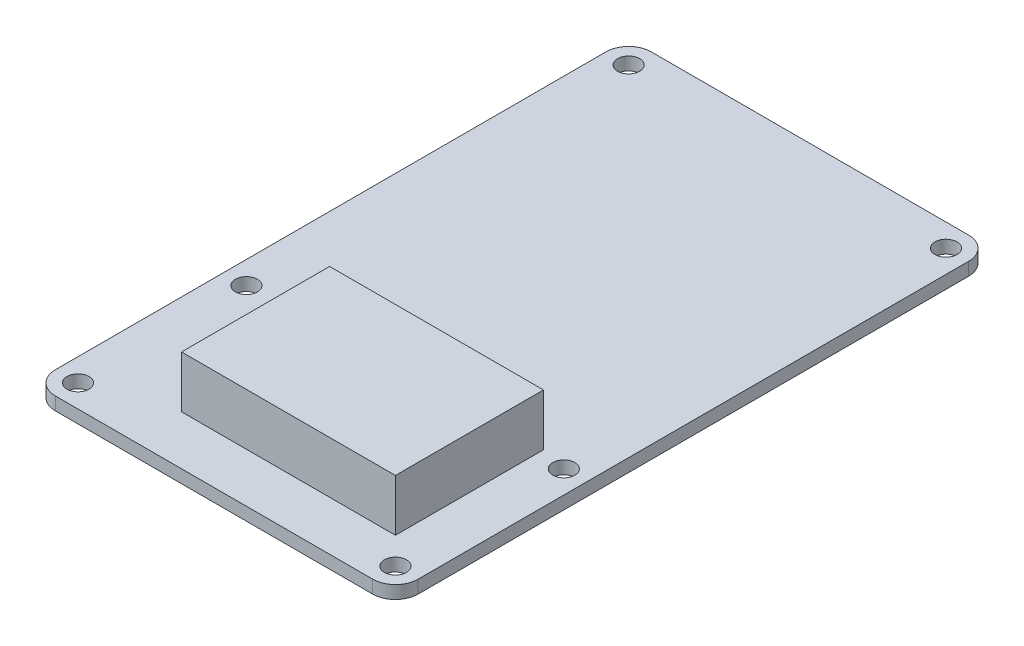
ISO-10303-21;
HEADER;
FILE_DESCRIPTION(('STEP AP214'),'2;1');
FILE_NAME('part.step','',(''),(''),'','','');
FILE_SCHEMA(('AUTOMOTIVE_DESIGN { 1 0 10303 214 1 1 1 1 }'));
ENDSEC;
DATA;
#1=APPLICATION_CONTEXT('core data for automotive mechanical design processes');
#2=APPLICATION_PROTOCOL_DEFINITION('international standard','automotive_design',2000,#1);
#3=PRODUCT_CONTEXT('',#1,'mechanical');
#4=PRODUCT('Part','Part','',(#3));
#5=PRODUCT_RELATED_PRODUCT_CATEGORY('part','',(#4));
#6=PRODUCT_DEFINITION_FORMATION('','',#4);
#7=PRODUCT_DEFINITION_CONTEXT('part definition',#1,'design');
#8=PRODUCT_DEFINITION('design','',#6,#7);
#9=PRODUCT_DEFINITION_SHAPE('','',#8);
#10=(LENGTH_UNIT() NAMED_UNIT(*) SI_UNIT(.MILLI.,.METRE.));
#11=(NAMED_UNIT(*) PLANE_ANGLE_UNIT() SI_UNIT($,.RADIAN.));
#12=(NAMED_UNIT(*) SI_UNIT($,.STERADIAN.) SOLID_ANGLE_UNIT());
#13=UNCERTAINTY_MEASURE_WITH_UNIT(LENGTH_MEASURE(1.E-05),#10,'distance_accuracy_value','');
#14=(GEOMETRIC_REPRESENTATION_CONTEXT(3) GLOBAL_UNCERTAINTY_ASSIGNED_CONTEXT((#13)) GLOBAL_UNIT_ASSIGNED_CONTEXT((#10,
#11,#12)) REPRESENTATION_CONTEXT('',''));
#15=CARTESIAN_POINT('',(0.,0.,0.));
#16=DIRECTION('',(0.,0.,1.));
#17=DIRECTION('',(1.,0.,0.));
#18=AXIS2_PLACEMENT_3D('',#15,#16,#17);
#19=CARTESIAN_POINT('',(24.5,2.,42.5));
#20=DIRECTION('',(0.,-1.,0.));
#21=DIRECTION('',(0.,0.,-1.));
#22=AXIS2_PLACEMENT_3D('',#19,#20,#21);
#23=PLANE('',#22);
#24=CARTESIAN_POINT('',(24.5,2.,42.5));
#25=DIRECTION('',(0.,-1.,0.));
#26=DIRECTION('',(0.,0.,-1.));
#27=AXIS2_PLACEMENT_3D('',#24,#25,#26);
#28=CIRCLE('',#27,1.7);
#29=CARTESIAN_POINT('',(24.5,2.,40.8));
#30=VERTEX_POINT('',#29);
#31=EDGE_CURVE('E254',#30,#30,#28,.T.);
#32=ORIENTED_EDGE('',*,*,#31,.T.);
#33=EDGE_LOOP('',(#32));
#34=FACE_BOUND('',#33,.T.);
#35=CARTESIAN_POINT('',(-24.5,2.,42.5));
#36=DIRECTION('',(0.,-1.,0.));
#37=DIRECTION('',(0.,0.,-1.));
#38=AXIS2_PLACEMENT_3D('',#35,#36,#37);
#39=CIRCLE('',#38,1.7);
#40=CARTESIAN_POINT('',(-24.5,2.,40.8));
#41=VERTEX_POINT('',#40);
#42=EDGE_CURVE('E248',#41,#41,#39,.T.);
#43=ORIENTED_EDGE('',*,*,#42,.T.);
#44=EDGE_LOOP('',(#43));
#45=FACE_BOUND('',#44,.T.);
#46=CARTESIAN_POINT('',(-24.5,2.,16.5));
#47=DIRECTION('',(0.,-1.,0.));
#48=DIRECTION('',(0.,0.,-1.));
#49=AXIS2_PLACEMENT_3D('',#46,#47,#48);
#50=CIRCLE('',#49,1.7);
#51=CARTESIAN_POINT('',(-24.5,2.,14.8));
#52=VERTEX_POINT('',#51);
#53=EDGE_CURVE('E242',#52,#52,#50,.T.);
#54=ORIENTED_EDGE('',*,*,#53,.T.);
#55=EDGE_LOOP('',(#54));
#56=FACE_BOUND('',#55,.T.);
#57=CARTESIAN_POINT('',(24.5,2.,16.5));
#58=DIRECTION('',(0.,-1.,0.));
#59=DIRECTION('',(0.,0.,-1.));
#60=AXIS2_PLACEMENT_3D('',#57,#58,#59);
#61=CIRCLE('',#60,1.7);
#62=CARTESIAN_POINT('',(24.5,2.,14.8));
#63=VERTEX_POINT('',#62);
#64=EDGE_CURVE('E236',#63,#63,#61,.T.);
#65=ORIENTED_EDGE('',*,*,#64,.T.);
#66=EDGE_LOOP('',(#65));
#67=FACE_BOUND('',#66,.T.);
#68=CARTESIAN_POINT('',(24.5,2.,-42.5));
#69=DIRECTION('',(0.,-1.,0.));
#70=DIRECTION('',(0.,0.,-1.));
#71=AXIS2_PLACEMENT_3D('',#68,#69,#70);
#72=CIRCLE('',#71,1.7);
#73=CARTESIAN_POINT('',(24.5,2.,-44.2));
#74=VERTEX_POINT('',#73);
#75=EDGE_CURVE('E230',#74,#74,#72,.T.);
#76=ORIENTED_EDGE('',*,*,#75,.T.);
#77=EDGE_LOOP('',(#76));
#78=FACE_BOUND('',#77,.T.);
#79=CARTESIAN_POINT('',(-24.5,2.,-42.5));
#80=DIRECTION('',(0.,-1.,0.));
#81=DIRECTION('',(0.,0.,-1.));
#82=AXIS2_PLACEMENT_3D('',#79,#80,#81);
#83=CIRCLE('',#82,1.7);
#84=CARTESIAN_POINT('',(-24.5,2.,-44.2));
#85=VERTEX_POINT('',#84);
#86=EDGE_CURVE('E224',#85,#85,#83,.T.);
#87=ORIENTED_EDGE('',*,*,#86,.T.);
#88=EDGE_LOOP('',(#87));
#89=FACE_BOUND('',#88,.T.);
#90=CARTESIAN_POINT('',(24.5,2.,42.5));
#91=DIRECTION('',(0.,1.,0.));
#92=DIRECTION('',(0.,0.,-1.));
#93=AXIS2_PLACEMENT_3D('',#90,#91,#92);
#94=CIRCLE('',#93,3.5);
#95=CARTESIAN_POINT('',(24.5,2.,46.));
#96=VERTEX_POINT('',#95);
#97=CARTESIAN_POINT('',(28.,2.,42.5));
#98=VERTEX_POINT('',#97);
#99=EDGE_CURVE('E159',#96,#98,#94,.T.);
#100=ORIENTED_EDGE('',*,*,#99,.T.);
#101=DIRECTION('',(0.,0.,-1.));
#102=VECTOR('',#101,1.);
#103=CARTESIAN_POINT('',(28.,2.,-42.5));
#104=LINE('',#103,#102);
#105=CARTESIAN_POINT('',(28.,2.,-42.5));
#106=VERTEX_POINT('',#105);
#107=EDGE_CURVE('E100',#98,#106,#104,.T.);
#108=ORIENTED_EDGE('',*,*,#107,.T.);
#109=CARTESIAN_POINT('',(24.5,2.,-42.5));
#110=DIRECTION('',(0.,1.,0.));
#111=DIRECTION('',(0.,0.,-1.));
#112=AXIS2_PLACEMENT_3D('',#109,#110,#111);
#113=CIRCLE('',#112,3.5);
#114=CARTESIAN_POINT('',(24.5,2.,-46.));
#115=VERTEX_POINT('',#114);
#116=EDGE_CURVE('E174',#106,#115,#113,.T.);
#117=ORIENTED_EDGE('',*,*,#116,.T.);
#118=DIRECTION('',(-1.,0.,0.));
#119=VECTOR('',#118,1.);
#120=CARTESIAN_POINT('',(24.5,2.,-46.));
#121=LINE('',#120,#119);
#122=CARTESIAN_POINT('',(-24.5,2.,-46.));
#123=VERTEX_POINT('',#122);
#124=EDGE_CURVE('E186',#115,#123,#121,.T.);
#125=ORIENTED_EDGE('',*,*,#124,.T.);
#126=CARTESIAN_POINT('',(-24.5,2.,-42.5));
#127=DIRECTION('',(0.,1.,0.));
#128=DIRECTION('',(0.,0.,1.));
#129=AXIS2_PLACEMENT_3D('',#126,#127,#128);
#130=CIRCLE('',#129,3.5);
#131=CARTESIAN_POINT('',(-28.,2.,-42.5));
#132=VERTEX_POINT('',#131);
#133=EDGE_CURVE('E122',#123,#132,#130,.T.);
#134=ORIENTED_EDGE('',*,*,#133,.T.);
#135=DIRECTION('',(0.,0.,1.));
#136=VECTOR('',#135,1.);
#137=CARTESIAN_POINT('',(-28.,2.,-42.5));
#138=LINE('',#137,#136);
#139=CARTESIAN_POINT('',(-28.,2.,42.5));
#140=VERTEX_POINT('',#139);
#141=EDGE_CURVE('E115',#132,#140,#138,.T.);
#142=ORIENTED_EDGE('',*,*,#141,.T.);
#143=CARTESIAN_POINT('',(-24.5,2.,42.5));
#144=DIRECTION('',(0.,1.,0.));
#145=DIRECTION('',(0.,0.,-1.));
#146=AXIS2_PLACEMENT_3D('',#143,#144,#145);
#147=CIRCLE('',#146,3.50000000000001);
#148=CARTESIAN_POINT('',(-24.5,2.,46.));
#149=VERTEX_POINT('',#148);
#150=EDGE_CURVE('E119',#140,#149,#147,.T.);
#151=ORIENTED_EDGE('',*,*,#150,.T.);
#152=DIRECTION('',(1.,0.,0.));
#153=VECTOR('',#152,1.);
#154=CARTESIAN_POINT('',(24.5,2.,46.));
#155=LINE('',#154,#153);
#156=EDGE_CURVE('E59',#149,#96,#155,.T.);
#157=ORIENTED_EDGE('',*,*,#156,.T.);
#158=EDGE_LOOP('',(#100,#108,#117,#125,#134,#142,#151,#157));
#159=FACE_BOUND('',#158,.T.);
#160=DIRECTION('',(0.,0.,1.));
#161=VECTOR('',#160,1.);
#162=CARTESIAN_POINT('',(-12.64,2.,42.5));
#163=LINE('',#162,#161);
#164=CARTESIAN_POINT('',(-12.64,2.,15.52));
#165=VERTEX_POINT('',#164);
#166=CARTESIAN_POINT('',(-12.64,2.,38.38));
#167=VERTEX_POINT('',#166);
#168=EDGE_CURVE('E147',#165,#167,#163,.T.);
#169=ORIENTED_EDGE('',*,*,#168,.F.);
#170=DIRECTION('',(1.,0.,0.));
#171=VECTOR('',#170,1.);
#172=CARTESIAN_POINT('',(24.5,2.,15.52));
#173=LINE('',#172,#171);
#174=CARTESIAN_POINT('',(20.38,2.,15.52));
#175=VERTEX_POINT('',#174);
#176=EDGE_CURVE('E200',#165,#175,#173,.T.);
#177=ORIENTED_EDGE('',*,*,#176,.T.);
#178=DIRECTION('',(0.,0.,1.));
#179=VECTOR('',#178,1.);
#180=CARTESIAN_POINT('',(20.38,2.,42.5));
#181=LINE('',#180,#179);
#182=CARTESIAN_POINT('',(20.38,2.,38.38));
#183=VERTEX_POINT('',#182);
#184=EDGE_CURVE('E197',#175,#183,#181,.T.);
#185=ORIENTED_EDGE('',*,*,#184,.T.);
#186=DIRECTION('',(1.,0.,0.));
#187=VECTOR('',#186,1.);
#188=CARTESIAN_POINT('',(24.5,2.,38.38));
#189=LINE('',#188,#187);
#190=EDGE_CURVE('E194',#167,#183,#189,.T.);
#191=ORIENTED_EDGE('',*,*,#190,.F.);
#192=EDGE_LOOP('',(#169,#177,#185,#191));
#193=FACE_BOUND('',#192,.T.);
#194=ADVANCED_FACE('F35',(#34,#45,#56,#67,#78,#89,#159,#193),#23,.F.);
#195=CARTESIAN_POINT('',(24.5,2.,42.5));
#196=DIRECTION('',(0.,-1.,0.));
#197=DIRECTION('',(0.,0.,-1.));
#198=AXIS2_PLACEMENT_3D('',#195,#196,#197);
#199=CYLINDRICAL_SURFACE('',#198,3.5);
#200=CARTESIAN_POINT('',(24.5,0.,42.5));
#201=DIRECTION('',(0.,1.,0.));
#202=DIRECTION('',(0.,0.,-1.));
#203=AXIS2_PLACEMENT_3D('',#200,#201,#202);
#204=CIRCLE('',#203,3.5);
#205=CARTESIAN_POINT('',(24.5,0.,46.));
#206=VERTEX_POINT('',#205);
#207=CARTESIAN_POINT('',(28.,0.,42.5));
#208=VERTEX_POINT('',#207);
#209=EDGE_CURVE('E143',#206,#208,#204,.T.);
#210=ORIENTED_EDGE('',*,*,#209,.T.);
#211=DIRECTION('',(0.,-1.,0.));
#212=VECTOR('',#211,1.);
#213=CARTESIAN_POINT('',(28.,2.,42.5));
#214=LINE('',#213,#212);
#215=EDGE_CURVE('E11',#98,#208,#214,.T.);
#216=ORIENTED_EDGE('',*,*,#215,.F.);
#217=ORIENTED_EDGE('',*,*,#99,.F.);
#218=DIRECTION('',(0.,-1.,0.));
#219=VECTOR('',#218,1.);
#220=CARTESIAN_POINT('',(24.5,2.,46.));
#221=LINE('',#220,#219);
#222=EDGE_CURVE('E139',#96,#206,#221,.T.);
#223=ORIENTED_EDGE('',*,*,#222,.T.);
#224=EDGE_LOOP('',(#210,#216,#217,#223));
#225=FACE_BOUND('',#224,.T.);
#226=ADVANCED_FACE('F37',(#225),#199,.T.);
#227=CARTESIAN_POINT('',(28.,2.,-42.5));
#228=DIRECTION('',(-1.,0.,0.));
#229=DIRECTION('',(0.,0.,1.));
#230=AXIS2_PLACEMENT_3D('',#227,#228,#229);
#231=PLANE('',#230);
#232=DIRECTION('',(0.,0.,-1.));
#233=VECTOR('',#232,1.);
#234=CARTESIAN_POINT('',(28.,0.,-42.5));
#235=LINE('',#234,#233);
#236=CARTESIAN_POINT('',(28.,0.,-42.5));
#237=VERTEX_POINT('',#236);
#238=EDGE_CURVE('E146',#208,#237,#235,.T.);
#239=ORIENTED_EDGE('',*,*,#238,.T.);
#240=DIRECTION('',(0.,-1.,0.));
#241=VECTOR('',#240,1.);
#242=CARTESIAN_POINT('',(28.,2.,-42.5));
#243=LINE('',#242,#241);
#244=EDGE_CURVE('E43',#106,#237,#243,.T.);
#245=ORIENTED_EDGE('',*,*,#244,.F.);
#246=ORIENTED_EDGE('',*,*,#107,.F.);
#247=ORIENTED_EDGE('',*,*,#215,.T.);
#248=EDGE_LOOP('',(#239,#245,#246,#247));
#249=FACE_BOUND('',#248,.T.);
#250=ADVANCED_FACE('F293',(#249),#231,.F.);
#251=CARTESIAN_POINT('',(24.5,2.,-42.5));
#252=DIRECTION('',(0.,-1.,0.));
#253=DIRECTION('',(0.,0.,-1.));
#254=AXIS2_PLACEMENT_3D('',#251,#252,#253);
#255=CYLINDRICAL_SURFACE('',#254,3.5);
#256=CARTESIAN_POINT('',(24.5,0.,-42.5));
#257=DIRECTION('',(0.,1.,0.));
#258=DIRECTION('',(0.,0.,-1.));
#259=AXIS2_PLACEMENT_3D('',#256,#257,#258);
#260=CIRCLE('',#259,3.5);
#261=CARTESIAN_POINT('',(24.5,0.,-46.));
#262=VERTEX_POINT('',#261);
#263=EDGE_CURVE('E149',#237,#262,#260,.T.);
#264=ORIENTED_EDGE('',*,*,#263,.T.);
#265=DIRECTION('',(0.,-1.,0.));
#266=VECTOR('',#265,1.);
#267=CARTESIAN_POINT('',(24.5,2.,-46.));
#268=LINE('',#267,#266);
#269=EDGE_CURVE('E166',#115,#262,#268,.T.);
#270=ORIENTED_EDGE('',*,*,#269,.F.);
#271=ORIENTED_EDGE('',*,*,#116,.F.);
#272=ORIENTED_EDGE('',*,*,#244,.T.);
#273=EDGE_LOOP('',(#264,#270,#271,#272));
#274=FACE_BOUND('',#273,.T.);
#275=ADVANCED_FACE('F172',(#274),#255,.T.);
#276=CARTESIAN_POINT('',(24.5,2.,-46.));
#277=DIRECTION('',(0.,0.,1.));
#278=DIRECTION('',(1.,0.,0.));
#279=AXIS2_PLACEMENT_3D('',#276,#277,#278);
#280=PLANE('',#279);
#281=DIRECTION('',(-1.,0.,0.));
#282=VECTOR('',#281,1.);
#283=CARTESIAN_POINT('',(24.5,0.,-46.));
#284=LINE('',#283,#282);
#285=CARTESIAN_POINT('',(-24.5,0.,-46.));
#286=VERTEX_POINT('',#285);
#287=EDGE_CURVE('E151',#262,#286,#284,.T.);
#288=ORIENTED_EDGE('',*,*,#287,.T.);
#289=DIRECTION('',(0.,-1.,0.));
#290=VECTOR('',#289,1.);
#291=CARTESIAN_POINT('',(-24.5,2.,-46.));
#292=LINE('',#291,#290);
#293=EDGE_CURVE('E163',#123,#286,#292,.T.);
#294=ORIENTED_EDGE('',*,*,#293,.F.);
#295=ORIENTED_EDGE('',*,*,#124,.F.);
#296=ORIENTED_EDGE('',*,*,#269,.T.);
#297=EDGE_LOOP('',(#288,#294,#295,#296));
#298=FACE_BOUND('',#297,.T.);
#299=ADVANCED_FACE('F182',(#298),#280,.F.);
#300=CARTESIAN_POINT('',(-24.5,2.,-42.5));
#301=DIRECTION('',(0.,-1.,0.));
#302=DIRECTION('',(0.,0.,-1.));
#303=AXIS2_PLACEMENT_3D('',#300,#301,#302);
#304=CYLINDRICAL_SURFACE('',#303,3.5);
#305=CARTESIAN_POINT('',(-24.5,0.,-42.5));
#306=DIRECTION('',(0.,1.,0.));
#307=DIRECTION('',(0.,0.,1.));
#308=AXIS2_PLACEMENT_3D('',#305,#306,#307);
#309=CIRCLE('',#308,3.5);
#310=CARTESIAN_POINT('',(-28.,0.,-42.5));
#311=VERTEX_POINT('',#310);
#312=EDGE_CURVE('E153',#286,#311,#309,.T.);
#313=ORIENTED_EDGE('',*,*,#312,.T.);
#314=DIRECTION('',(0.,-1.,0.));
#315=VECTOR('',#314,1.);
#316=CARTESIAN_POINT('',(-28.,2.,-42.5));
#317=LINE('',#316,#315);
#318=EDGE_CURVE('E134',#132,#311,#317,.T.);
#319=ORIENTED_EDGE('',*,*,#318,.F.);
#320=ORIENTED_EDGE('',*,*,#133,.F.);
#321=ORIENTED_EDGE('',*,*,#293,.T.);
#322=EDGE_LOOP('',(#313,#319,#320,#321));
#323=FACE_BOUND('',#322,.T.);
#324=ADVANCED_FACE('F185',(#323),#304,.T.);
#325=CARTESIAN_POINT('',(-28.,2.,-42.5));
#326=DIRECTION('',(1.,0.,0.));
#327=DIRECTION('',(0.,0.,-1.));
#328=AXIS2_PLACEMENT_3D('',#325,#326,#327);
#329=PLANE('',#328);
#330=DIRECTION('',(0.,0.,1.));
#331=VECTOR('',#330,1.);
#332=CARTESIAN_POINT('',(-28.,0.,-42.5));
#333=LINE('',#332,#331);
#334=CARTESIAN_POINT('',(-28.,0.,42.5));
#335=VERTEX_POINT('',#334);
#336=EDGE_CURVE('E131',#311,#335,#333,.T.);
#337=ORIENTED_EDGE('',*,*,#336,.T.);
#338=DIRECTION('',(0.,-1.,0.));
#339=VECTOR('',#338,1.);
#340=CARTESIAN_POINT('',(-28.,2.,42.5));
#341=LINE('',#340,#339);
#342=EDGE_CURVE('E128',#140,#335,#341,.T.);
#343=ORIENTED_EDGE('',*,*,#342,.F.);
#344=ORIENTED_EDGE('',*,*,#141,.F.);
#345=ORIENTED_EDGE('',*,*,#318,.T.);
#346=EDGE_LOOP('',(#337,#343,#344,#345));
#347=FACE_BOUND('',#346,.T.);
#348=ADVANCED_FACE('F129',(#347),#329,.F.);
#349=CARTESIAN_POINT('',(-24.5,2.,42.5));
#350=DIRECTION('',(0.,-1.,0.));
#351=DIRECTION('',(0.,0.,-1.));
#352=AXIS2_PLACEMENT_3D('',#349,#350,#351);
#353=CYLINDRICAL_SURFACE('',#352,3.50000000000001);
#354=CARTESIAN_POINT('',(-24.5,0.,42.5));
#355=DIRECTION('',(0.,1.,0.));
#356=DIRECTION('',(0.,0.,-1.));
#357=AXIS2_PLACEMENT_3D('',#354,#355,#356);
#358=CIRCLE('',#357,3.50000000000001);
#359=CARTESIAN_POINT('',(-24.5,0.,46.));
#360=VERTEX_POINT('',#359);
#361=EDGE_CURVE('E156',#335,#360,#358,.T.);
#362=ORIENTED_EDGE('',*,*,#361,.T.);
#363=DIRECTION('',(0.,-1.,0.));
#364=VECTOR('',#363,1.);
#365=CARTESIAN_POINT('',(-24.5,2.,46.));
#366=LINE('',#365,#364);
#367=EDGE_CURVE('E135',#149,#360,#366,.T.);
#368=ORIENTED_EDGE('',*,*,#367,.F.);
#369=ORIENTED_EDGE('',*,*,#150,.F.);
#370=ORIENTED_EDGE('',*,*,#342,.T.);
#371=EDGE_LOOP('',(#362,#368,#369,#370));
#372=FACE_BOUND('',#371,.T.);
#373=ADVANCED_FACE('F137',(#372),#353,.T.);
#374=CARTESIAN_POINT('',(24.5,2.,46.));
#375=DIRECTION('',(0.,0.,-1.));
#376=DIRECTION('',(-1.,0.,0.));
#377=AXIS2_PLACEMENT_3D('',#374,#375,#376);
#378=PLANE('',#377);
#379=DIRECTION('',(1.,0.,0.));
#380=VECTOR('',#379,1.);
#381=CARTESIAN_POINT('',(24.5,0.,46.));
#382=LINE('',#381,#380);
#383=EDGE_CURVE('E92',#360,#206,#382,.T.);
#384=ORIENTED_EDGE('',*,*,#383,.T.);
#385=ORIENTED_EDGE('',*,*,#222,.F.);
#386=ORIENTED_EDGE('',*,*,#156,.F.);
#387=ORIENTED_EDGE('',*,*,#367,.T.);
#388=EDGE_LOOP('',(#384,#385,#386,#387));
#389=FACE_BOUND('',#388,.T.);
#390=ADVANCED_FACE('F267',(#389),#378,.F.);
#391=CARTESIAN_POINT('',(24.5,0.,42.5));
#392=DIRECTION('',(0.,-1.,0.));
#393=DIRECTION('',(0.,0.,-1.));
#394=AXIS2_PLACEMENT_3D('',#391,#392,#393);
#395=PLANE('',#394);
#396=CARTESIAN_POINT('',(24.5,0.,42.5));
#397=DIRECTION('',(0.,-1.,0.));
#398=DIRECTION('',(0.,0.,-1.));
#399=AXIS2_PLACEMENT_3D('',#396,#397,#398);
#400=CIRCLE('',#399,1.7);
#401=CARTESIAN_POINT('',(24.5,0.,40.8));
#402=VERTEX_POINT('',#401);
#403=EDGE_CURVE('E257',#402,#402,#400,.T.);
#404=ORIENTED_EDGE('',*,*,#403,.F.);
#405=EDGE_LOOP('',(#404));
#406=FACE_BOUND('',#405,.T.);
#407=CARTESIAN_POINT('',(-24.5,0.,42.5));
#408=DIRECTION('',(0.,-1.,0.));
#409=DIRECTION('',(0.,0.,-1.));
#410=AXIS2_PLACEMENT_3D('',#407,#408,#409);
#411=CIRCLE('',#410,1.7);
#412=CARTESIAN_POINT('',(-24.5,0.,40.8));
#413=VERTEX_POINT('',#412);
#414=EDGE_CURVE('E251',#413,#413,#411,.T.);
#415=ORIENTED_EDGE('',*,*,#414,.F.);
#416=EDGE_LOOP('',(#415));
#417=FACE_BOUND('',#416,.T.);
#418=CARTESIAN_POINT('',(-24.5,0.,16.5));
#419=DIRECTION('',(0.,-1.,0.));
#420=DIRECTION('',(0.,0.,-1.));
#421=AXIS2_PLACEMENT_3D('',#418,#419,#420);
#422=CIRCLE('',#421,1.7);
#423=CARTESIAN_POINT('',(-24.5,0.,14.8));
#424=VERTEX_POINT('',#423);
#425=EDGE_CURVE('E245',#424,#424,#422,.T.);
#426=ORIENTED_EDGE('',*,*,#425,.F.);
#427=EDGE_LOOP('',(#426));
#428=FACE_BOUND('',#427,.T.);
#429=CARTESIAN_POINT('',(24.5,0.,16.5));
#430=DIRECTION('',(0.,-1.,0.));
#431=DIRECTION('',(0.,0.,-1.));
#432=AXIS2_PLACEMENT_3D('',#429,#430,#431);
#433=CIRCLE('',#432,1.7);
#434=CARTESIAN_POINT('',(24.5,0.,14.8));
#435=VERTEX_POINT('',#434);
#436=EDGE_CURVE('E239',#435,#435,#433,.T.);
#437=ORIENTED_EDGE('',*,*,#436,.F.);
#438=EDGE_LOOP('',(#437));
#439=FACE_BOUND('',#438,.T.);
#440=CARTESIAN_POINT('',(24.5,0.,-42.5));
#441=DIRECTION('',(0.,-1.,0.));
#442=DIRECTION('',(0.,0.,-1.));
#443=AXIS2_PLACEMENT_3D('',#440,#441,#442);
#444=CIRCLE('',#443,1.7);
#445=CARTESIAN_POINT('',(24.5,0.,-44.2));
#446=VERTEX_POINT('',#445);
#447=EDGE_CURVE('E233',#446,#446,#444,.T.);
#448=ORIENTED_EDGE('',*,*,#447,.F.);
#449=EDGE_LOOP('',(#448));
#450=FACE_BOUND('',#449,.T.);
#451=CARTESIAN_POINT('',(-24.5,0.,-42.5));
#452=DIRECTION('',(0.,-1.,0.));
#453=DIRECTION('',(0.,0.,-1.));
#454=AXIS2_PLACEMENT_3D('',#451,#452,#453);
#455=CIRCLE('',#454,1.7);
#456=CARTESIAN_POINT('',(-24.5,0.,-44.2));
#457=VERTEX_POINT('',#456);
#458=EDGE_CURVE('E227',#457,#457,#455,.T.);
#459=ORIENTED_EDGE('',*,*,#458,.F.);
#460=EDGE_LOOP('',(#459));
#461=FACE_BOUND('',#460,.T.);
#462=ORIENTED_EDGE('',*,*,#209,.F.);
#463=ORIENTED_EDGE('',*,*,#383,.F.);
#464=ORIENTED_EDGE('',*,*,#361,.F.);
#465=ORIENTED_EDGE('',*,*,#336,.F.);
#466=ORIENTED_EDGE('',*,*,#312,.F.);
#467=ORIENTED_EDGE('',*,*,#287,.F.);
#468=ORIENTED_EDGE('',*,*,#263,.F.);
#469=ORIENTED_EDGE('',*,*,#238,.F.);
#470=EDGE_LOOP('',(#462,#463,#464,#465,#466,#467,#468,#469));
#471=FACE_BOUND('',#470,.T.);
#472=ADVANCED_FACE('F178',(#406,#417,#428,#439,#450,#461,#471),#395,.T.);
#473=CARTESIAN_POINT('',(-12.64,10.,15.52));
#474=DIRECTION('',(1.,0.,0.));
#475=DIRECTION('',(0.,0.,-1.));
#476=AXIS2_PLACEMENT_3D('',#473,#474,#475);
#477=PLANE('',#476);
#478=DIRECTION('',(0.,-1.,0.));
#479=VECTOR('',#478,1.);
#480=CARTESIAN_POINT('',(-12.64,10.,15.52));
#481=LINE('',#480,#479);
#482=CARTESIAN_POINT('',(-12.64,10.,15.52));
#483=VERTEX_POINT('',#482);
#484=EDGE_CURVE('E210',#483,#165,#481,.T.);
#485=ORIENTED_EDGE('',*,*,#484,.T.);
#486=ORIENTED_EDGE('',*,*,#168,.T.);
#487=DIRECTION('',(0.,-1.,0.));
#488=VECTOR('',#487,1.);
#489=CARTESIAN_POINT('',(-12.64,10.,38.38));
#490=LINE('',#489,#488);
#491=CARTESIAN_POINT('',(-12.64,10.,38.38));
#492=VERTEX_POINT('',#491);
#493=EDGE_CURVE('E203',#492,#167,#490,.T.);
#494=ORIENTED_EDGE('',*,*,#493,.F.);
#495=DIRECTION('',(0.,0.,1.));
#496=VECTOR('',#495,1.);
#497=CARTESIAN_POINT('',(-12.64,10.,15.52));
#498=LINE('',#497,#496);
#499=EDGE_CURVE('E221',#483,#492,#498,.T.);
#500=ORIENTED_EDGE('',*,*,#499,.F.);
#501=EDGE_LOOP('',(#485,#486,#494,#500));
#502=FACE_BOUND('',#501,.T.);
#503=ADVANCED_FACE('F266',(#502),#477,.F.);
#504=CARTESIAN_POINT('',(-12.64,10.,38.38));
#505=DIRECTION('',(0.,0.,-1.));
#506=DIRECTION('',(-1.,0.,0.));
#507=AXIS2_PLACEMENT_3D('',#504,#505,#506);
#508=PLANE('',#507);
#509=ORIENTED_EDGE('',*,*,#493,.T.);
#510=ORIENTED_EDGE('',*,*,#190,.T.);
#511=DIRECTION('',(0.,-1.,0.));
#512=VECTOR('',#511,1.);
#513=CARTESIAN_POINT('',(20.38,10.,38.38));
#514=LINE('',#513,#512);
#515=CARTESIAN_POINT('',(20.38,10.,38.38));
#516=VERTEX_POINT('',#515);
#517=EDGE_CURVE('E206',#516,#183,#514,.T.);
#518=ORIENTED_EDGE('',*,*,#517,.F.);
#519=DIRECTION('',(1.,0.,0.));
#520=VECTOR('',#519,1.);
#521=CARTESIAN_POINT('',(-12.64,10.,38.38));
#522=LINE('',#521,#520);
#523=EDGE_CURVE('E218',#492,#516,#522,.T.);
#524=ORIENTED_EDGE('',*,*,#523,.F.);
#525=EDGE_LOOP('',(#509,#510,#518,#524));
#526=FACE_BOUND('',#525,.T.);
#527=ADVANCED_FACE('F352',(#526),#508,.F.);
#528=CARTESIAN_POINT('',(20.38,10.,15.52));
#529=DIRECTION('',(1.,0.,0.));
#530=DIRECTION('',(0.,0.,-1.));
#531=AXIS2_PLACEMENT_3D('',#528,#529,#530);
#532=PLANE('',#531);
#533=ORIENTED_EDGE('',*,*,#184,.F.);
#534=DIRECTION('',(0.,-1.,0.));
#535=VECTOR('',#534,1.);
#536=CARTESIAN_POINT('',(20.38,10.,15.52));
#537=LINE('',#536,#535);
#538=CARTESIAN_POINT('',(20.38,10.,15.52));
#539=VERTEX_POINT('',#538);
#540=EDGE_CURVE('E50',#539,#175,#537,.T.);
#541=ORIENTED_EDGE('',*,*,#540,.F.);
#542=DIRECTION('',(0.,0.,1.));
#543=VECTOR('',#542,1.);
#544=CARTESIAN_POINT('',(20.38,10.,15.52));
#545=LINE('',#544,#543);
#546=EDGE_CURVE('E215',#539,#516,#545,.T.);
#547=ORIENTED_EDGE('',*,*,#546,.T.);
#548=ORIENTED_EDGE('',*,*,#517,.T.);
#549=EDGE_LOOP('',(#533,#541,#547,#548));
#550=FACE_BOUND('',#549,.T.);
#551=ADVANCED_FACE('F359',(#550),#532,.T.);
#552=CARTESIAN_POINT('',(-12.64,10.,15.52));
#553=DIRECTION('',(0.,0.,-1.));
#554=DIRECTION('',(-1.,0.,0.));
#555=AXIS2_PLACEMENT_3D('',#552,#553,#554);
#556=PLANE('',#555);
#557=ORIENTED_EDGE('',*,*,#176,.F.);
#558=ORIENTED_EDGE('',*,*,#484,.F.);
#559=DIRECTION('',(1.,0.,0.));
#560=VECTOR('',#559,1.);
#561=CARTESIAN_POINT('',(-12.64,10.,15.52));
#562=LINE('',#561,#560);
#563=EDGE_CURVE('E213',#483,#539,#562,.T.);
#564=ORIENTED_EDGE('',*,*,#563,.T.);
#565=ORIENTED_EDGE('',*,*,#540,.T.);
#566=EDGE_LOOP('',(#557,#558,#564,#565));
#567=FACE_BOUND('',#566,.T.);
#568=ADVANCED_FACE('F366',(#567),#556,.T.);
#569=CARTESIAN_POINT('',(0.,10.,0.));
#570=DIRECTION('',(0.,1.,0.));
#571=DIRECTION('',(0.,0.,1.));
#572=AXIS2_PLACEMENT_3D('',#569,#570,#571);
#573=PLANE('',#572);
#574=ORIENTED_EDGE('',*,*,#499,.T.);
#575=ORIENTED_EDGE('',*,*,#523,.T.);
#576=ORIENTED_EDGE('',*,*,#546,.F.);
#577=ORIENTED_EDGE('',*,*,#563,.F.);
#578=EDGE_LOOP('',(#574,#575,#576,#577));
#579=FACE_BOUND('',#578,.T.);
#580=ADVANCED_FACE('F283',(#579),#573,.T.);
#581=CARTESIAN_POINT('',(-24.5,0.,-42.5));
#582=DIRECTION('',(0.,-1.,0.));
#583=DIRECTION('',(0.,0.,-1.));
#584=AXIS2_PLACEMENT_3D('',#581,#582,#583);
#585=CYLINDRICAL_SURFACE('',#584,1.7);
#586=ORIENTED_EDGE('',*,*,#458,.T.);
#587=EDGE_LOOP('',(#586));
#588=FACE_BOUND('',#587,.T.);
#589=ORIENTED_EDGE('',*,*,#86,.F.);
#590=EDGE_LOOP('',(#589));
#591=FACE_BOUND('',#590,.T.);
#592=ADVANCED_FACE('F279',(#588,#591),#585,.F.);
#593=CARTESIAN_POINT('',(24.5,0.,-42.5));
#594=DIRECTION('',(0.,-1.,0.));
#595=DIRECTION('',(0.,0.,-1.));
#596=AXIS2_PLACEMENT_3D('',#593,#594,#595);
#597=CYLINDRICAL_SURFACE('',#596,1.7);
#598=ORIENTED_EDGE('',*,*,#447,.T.);
#599=EDGE_LOOP('',(#598));
#600=FACE_BOUND('',#599,.T.);
#601=ORIENTED_EDGE('',*,*,#75,.F.);
#602=EDGE_LOOP('',(#601));
#603=FACE_BOUND('',#602,.T.);
#604=ADVANCED_FACE('F282',(#600,#603),#597,.F.);
#605=CARTESIAN_POINT('',(24.5,0.,16.5));
#606=DIRECTION('',(0.,-1.,0.));
#607=DIRECTION('',(0.,0.,-1.));
#608=AXIS2_PLACEMENT_3D('',#605,#606,#607);
#609=CYLINDRICAL_SURFACE('',#608,1.7);
#610=ORIENTED_EDGE('',*,*,#436,.T.);
#611=EDGE_LOOP('',(#610));
#612=FACE_BOUND('',#611,.T.);
#613=ORIENTED_EDGE('',*,*,#64,.F.);
#614=EDGE_LOOP('',(#613));
#615=FACE_BOUND('',#614,.T.);
#616=ADVANCED_FACE('F390',(#612,#615),#609,.F.);
#617=CARTESIAN_POINT('',(-24.5,0.,16.5));
#618=DIRECTION('',(0.,-1.,0.));
#619=DIRECTION('',(0.,0.,-1.));
#620=AXIS2_PLACEMENT_3D('',#617,#618,#619);
#621=CYLINDRICAL_SURFACE('',#620,1.7);
#622=ORIENTED_EDGE('',*,*,#425,.T.);
#623=EDGE_LOOP('',(#622));
#624=FACE_BOUND('',#623,.T.);
#625=ORIENTED_EDGE('',*,*,#53,.F.);
#626=EDGE_LOOP('',(#625));
#627=FACE_BOUND('',#626,.T.);
#628=ADVANCED_FACE('F398',(#624,#627),#621,.F.);
#629=CARTESIAN_POINT('',(-24.5,0.,42.5));
#630=DIRECTION('',(0.,-1.,0.));
#631=DIRECTION('',(0.,0.,-1.));
#632=AXIS2_PLACEMENT_3D('',#629,#630,#631);
#633=CYLINDRICAL_SURFACE('',#632,1.7);
#634=ORIENTED_EDGE('',*,*,#414,.T.);
#635=EDGE_LOOP('',(#634));
#636=FACE_BOUND('',#635,.T.);
#637=ORIENTED_EDGE('',*,*,#42,.F.);
#638=EDGE_LOOP('',(#637));
#639=FACE_BOUND('',#638,.T.);
#640=ADVANCED_FACE('F406',(#636,#639),#633,.F.);
#641=CARTESIAN_POINT('',(24.5,0.,42.5));
#642=DIRECTION('',(0.,-1.,0.));
#643=DIRECTION('',(0.,0.,-1.));
#644=AXIS2_PLACEMENT_3D('',#641,#642,#643);
#645=CYLINDRICAL_SURFACE('',#644,1.7);
#646=ORIENTED_EDGE('',*,*,#403,.T.);
#647=EDGE_LOOP('',(#646));
#648=FACE_BOUND('',#647,.T.);
#649=ORIENTED_EDGE('',*,*,#31,.F.);
#650=EDGE_LOOP('',(#649));
#651=FACE_BOUND('',#650,.T.);
#652=ADVANCED_FACE('F261',(#648,#651),#645,.F.);
#653=CLOSED_SHELL('',(#194,#226,#250,#275,#299,#324,#348,#373,#390,#472,#503,#527,#551,#568,
#580,#592,#604,#616,#628,#640,#652));
#654=MANIFOLD_SOLID_BREP('B2',#653);
#655=ADVANCED_BREP_SHAPE_REPRESENTATION('',(#18,#654),#14);
#656=SHAPE_DEFINITION_REPRESENTATION(#9,#655);
ENDSEC;
END-ISO-10303-21;
